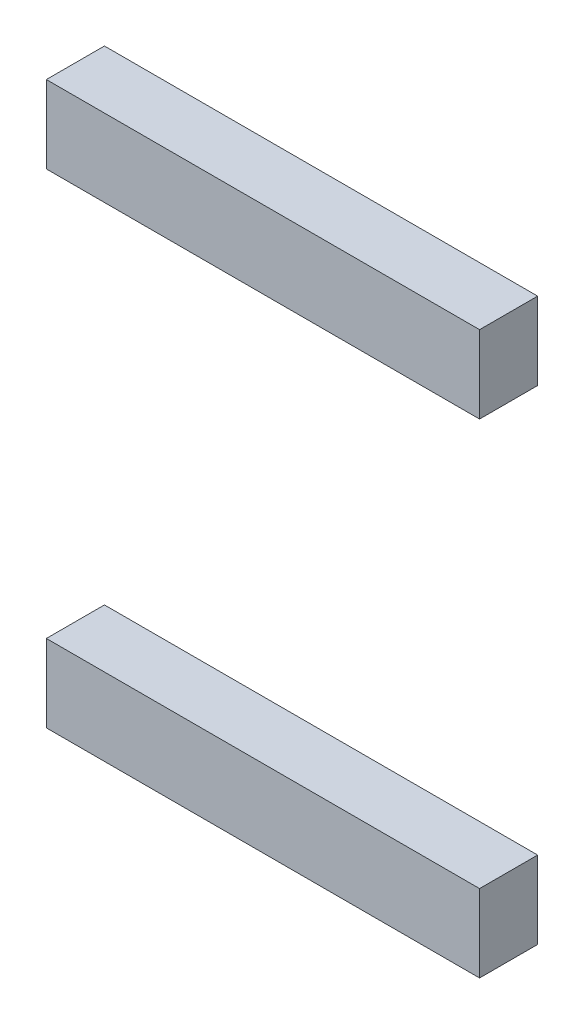
ISO-10303-21;
HEADER;
FILE_DESCRIPTION(('STEP AP214'),'2;1');
FILE_NAME('part.step','',(''),(''),'','','');
FILE_SCHEMA(('AUTOMOTIVE_DESIGN { 1 0 10303 214 1 1 1 1 }'));
ENDSEC;
DATA;
#1=APPLICATION_CONTEXT('core data for automotive mechanical design processes');
#2=APPLICATION_PROTOCOL_DEFINITION('international standard','automotive_design',2000,#1);
#3=PRODUCT_CONTEXT('',#1,'mechanical');
#4=PRODUCT('Part','Part','',(#3));
#5=PRODUCT_RELATED_PRODUCT_CATEGORY('part','',(#4));
#6=PRODUCT_DEFINITION_FORMATION('','',#4);
#7=PRODUCT_DEFINITION_CONTEXT('part definition',#1,'design');
#8=PRODUCT_DEFINITION('design','',#6,#7);
#9=PRODUCT_DEFINITION_SHAPE('','',#8);
#10=(LENGTH_UNIT() NAMED_UNIT(*) SI_UNIT(.MILLI.,.METRE.));
#11=(NAMED_UNIT(*) PLANE_ANGLE_UNIT() SI_UNIT($,.RADIAN.));
#12=(NAMED_UNIT(*) SI_UNIT($,.STERADIAN.) SOLID_ANGLE_UNIT());
#13=UNCERTAINTY_MEASURE_WITH_UNIT(LENGTH_MEASURE(1.E-05),#10,'distance_accuracy_value','');
#14=(GEOMETRIC_REPRESENTATION_CONTEXT(3) GLOBAL_UNCERTAINTY_ASSIGNED_CONTEXT((#13)) GLOBAL_UNIT_ASSIGNED_CONTEXT((#10,
#11,#12)) REPRESENTATION_CONTEXT('',''));
#15=CARTESIAN_POINT('',(0.,0.,0.));
#16=DIRECTION('',(0.,0.,1.));
#17=DIRECTION('',(1.,0.,0.));
#18=AXIS2_PLACEMENT_3D('',#15,#16,#17);
#19=CARTESIAN_POINT('',(-0.374999999999997,31.5,3.));
#20=DIRECTION('',(-1.,0.,0.));
#21=DIRECTION('',(0.,0.,1.));
#22=AXIS2_PLACEMENT_3D('',#19,#20,#21);
#23=PLANE('',#22);
#24=DIRECTION('',(0.,1.,0.));
#25=VECTOR('',#24,1.);
#26=CARTESIAN_POINT('',(-0.374999999999997,31.5,0.));
#27=LINE('',#26,#25);
#28=CARTESIAN_POINT('',(-0.374999999999997,31.5,0.));
#29=VERTEX_POINT('',#28);
#30=CARTESIAN_POINT('',(-0.374999999999997,35.5,0.));
#31=VERTEX_POINT('',#30);
#32=EDGE_CURVE('E106',#29,#31,#27,.T.);
#33=ORIENTED_EDGE('',*,*,#32,.T.);
#34=DIRECTION('',(0.,0.,-1.));
#35=VECTOR('',#34,1.);
#36=CARTESIAN_POINT('',(-0.374999999999997,35.5,3.));
#37=LINE('',#36,#35);
#38=CARTESIAN_POINT('',(-0.374999999999997,35.5,3.));
#39=VERTEX_POINT('',#38);
#40=EDGE_CURVE('E12',#39,#31,#37,.T.);
#41=ORIENTED_EDGE('',*,*,#40,.F.);
#42=DIRECTION('',(0.,1.,0.));
#43=VECTOR('',#42,1.);
#44=CARTESIAN_POINT('',(-0.374999999999997,31.5,3.));
#45=LINE('',#44,#43);
#46=CARTESIAN_POINT('',(-0.374999999999997,31.5,3.));
#47=VERTEX_POINT('',#46);
#48=EDGE_CURVE('E94',#47,#39,#45,.T.);
#49=ORIENTED_EDGE('',*,*,#48,.F.);
#50=DIRECTION('',(0.,0.,-1.));
#51=VECTOR('',#50,1.);
#52=CARTESIAN_POINT('',(-0.374999999999997,31.5,3.));
#53=LINE('',#52,#51);
#54=EDGE_CURVE('E102',#47,#29,#53,.T.);
#55=ORIENTED_EDGE('',*,*,#54,.T.);
#56=EDGE_LOOP('',(#33,#41,#49,#55));
#57=FACE_BOUND('',#56,.T.);
#58=ADVANCED_FACE('F43',(#57),#23,.F.);
#59=CARTESIAN_POINT('',(-0.374999999999997,35.5,3.));
#60=DIRECTION('',(0.,-1.,0.));
#61=DIRECTION('',(0.,0.,-1.));
#62=AXIS2_PLACEMENT_3D('',#59,#60,#61);
#63=PLANE('',#62);
#64=DIRECTION('',(-1.,0.,0.));
#65=VECTOR('',#64,1.);
#66=CARTESIAN_POINT('',(-0.374999999999997,35.5,0.));
#67=LINE('',#66,#65);
#68=CARTESIAN_POINT('',(-22.75,35.5,0.));
#69=VERTEX_POINT('',#68);
#70=EDGE_CURVE('E98',#31,#69,#67,.T.);
#71=ORIENTED_EDGE('',*,*,#70,.T.);
#72=DIRECTION('',(0.,0.,-1.));
#73=VECTOR('',#72,1.);
#74=CARTESIAN_POINT('',(-22.75,35.5,3.));
#75=LINE('',#74,#73);
#76=CARTESIAN_POINT('',(-22.75,35.5,3.));
#77=VERTEX_POINT('',#76);
#78=EDGE_CURVE('E51',#77,#69,#75,.T.);
#79=ORIENTED_EDGE('',*,*,#78,.F.);
#80=DIRECTION('',(-1.,0.,0.));
#81=VECTOR('',#80,1.);
#82=CARTESIAN_POINT('',(-0.374999999999997,35.5,3.));
#83=LINE('',#82,#81);
#84=EDGE_CURVE('E89',#39,#77,#83,.T.);
#85=ORIENTED_EDGE('',*,*,#84,.F.);
#86=ORIENTED_EDGE('',*,*,#40,.T.);
#87=EDGE_LOOP('',(#71,#79,#85,#86));
#88=FACE_BOUND('',#87,.T.);
#89=ADVANCED_FACE('F97',(#88),#63,.F.);
#90=CARTESIAN_POINT('',(-22.75,31.5,3.));
#91=DIRECTION('',(1.,0.,0.));
#92=DIRECTION('',(0.,0.,-1.));
#93=AXIS2_PLACEMENT_3D('',#90,#91,#92);
#94=PLANE('',#93);
#95=DIRECTION('',(0.,-1.,0.));
#96=VECTOR('',#95,1.);
#97=CARTESIAN_POINT('',(-22.75,31.5,0.));
#98=LINE('',#97,#96);
#99=CARTESIAN_POINT('',(-22.75,31.5,0.));
#100=VERTEX_POINT('',#99);
#101=EDGE_CURVE('E76',#69,#100,#98,.T.);
#102=ORIENTED_EDGE('',*,*,#101,.T.);
#103=DIRECTION('',(0.,0.,-1.));
#104=VECTOR('',#103,1.);
#105=CARTESIAN_POINT('',(-22.75,31.5,3.));
#106=LINE('',#105,#104);
#107=CARTESIAN_POINT('',(-22.75,31.5,3.));
#108=VERTEX_POINT('',#107);
#109=EDGE_CURVE('E99',#108,#100,#106,.T.);
#110=ORIENTED_EDGE('',*,*,#109,.F.);
#111=DIRECTION('',(0.,-1.,0.));
#112=VECTOR('',#111,1.);
#113=CARTESIAN_POINT('',(-22.75,31.5,3.));
#114=LINE('',#113,#112);
#115=EDGE_CURVE('E92',#77,#108,#114,.T.);
#116=ORIENTED_EDGE('',*,*,#115,.F.);
#117=ORIENTED_EDGE('',*,*,#78,.T.);
#118=EDGE_LOOP('',(#102,#110,#116,#117));
#119=FACE_BOUND('',#118,.T.);
#120=ADVANCED_FACE('F100',(#119),#94,.F.);
#121=CARTESIAN_POINT('',(-0.374999999999997,31.5,3.));
#122=DIRECTION('',(0.,1.,0.));
#123=DIRECTION('',(0.,0.,1.));
#124=AXIS2_PLACEMENT_3D('',#121,#122,#123);
#125=PLANE('',#124);
#126=DIRECTION('',(1.,0.,0.));
#127=VECTOR('',#126,1.);
#128=CARTESIAN_POINT('',(-0.374999999999997,31.5,0.));
#129=LINE('',#128,#127);
#130=EDGE_CURVE('E82',#100,#29,#129,.T.);
#131=ORIENTED_EDGE('',*,*,#130,.T.);
#132=ORIENTED_EDGE('',*,*,#54,.F.);
#133=DIRECTION('',(1.,0.,0.));
#134=VECTOR('',#133,1.);
#135=CARTESIAN_POINT('',(-0.374999999999997,31.5,3.));
#136=LINE('',#135,#134);
#137=EDGE_CURVE('E59',#108,#47,#136,.T.);
#138=ORIENTED_EDGE('',*,*,#137,.F.);
#139=ORIENTED_EDGE('',*,*,#109,.T.);
#140=EDGE_LOOP('',(#131,#132,#138,#139));
#141=FACE_BOUND('',#140,.T.);
#142=ADVANCED_FACE('F113',(#141),#125,.F.);
#143=CARTESIAN_POINT('',(0.,0.,3.));
#144=DIRECTION('',(0.,0.,1.));
#145=DIRECTION('',(1.,0.,0.));
#146=AXIS2_PLACEMENT_3D('',#143,#144,#145);
#147=PLANE('',#146);
#148=ORIENTED_EDGE('',*,*,#48,.T.);
#149=ORIENTED_EDGE('',*,*,#84,.T.);
#150=ORIENTED_EDGE('',*,*,#115,.T.);
#151=ORIENTED_EDGE('',*,*,#137,.T.);
#152=EDGE_LOOP('',(#148,#149,#150,#151));
#153=FACE_BOUND('',#152,.T.);
#154=ADVANCED_FACE('F90',(#153),#147,.T.);
#155=CARTESIAN_POINT('',(0.,0.,0.));
#156=DIRECTION('',(0.,0.,1.));
#157=DIRECTION('',(1.,0.,0.));
#158=AXIS2_PLACEMENT_3D('',#155,#156,#157);
#159=PLANE('',#158);
#160=ORIENTED_EDGE('',*,*,#32,.F.);
#161=ORIENTED_EDGE('',*,*,#130,.F.);
#162=ORIENTED_EDGE('',*,*,#101,.F.);
#163=ORIENTED_EDGE('',*,*,#70,.F.);
#164=EDGE_LOOP('',(#160,#161,#162,#163));
#165=FACE_BOUND('',#164,.T.);
#166=ADVANCED_FACE('F116',(#165),#159,.F.);
#167=CLOSED_SHELL('',(#58,#89,#120,#142,#154,#166));
#168=MANIFOLD_SOLID_BREP('B2',#167);
#169=CARTESIAN_POINT('',(-0.375,6.5,3.));
#170=DIRECTION('',(-1.,0.,0.));
#171=DIRECTION('',(0.,0.,1.));
#172=AXIS2_PLACEMENT_3D('',#169,#170,#171);
#173=PLANE('',#172);
#174=DIRECTION('',(0.,1.,0.));
#175=VECTOR('',#174,1.);
#176=CARTESIAN_POINT('',(-0.375,6.5,0.));
#177=LINE('',#176,#175);
#178=CARTESIAN_POINT('',(-0.375,6.5,0.));
#179=VERTEX_POINT('',#178);
#180=CARTESIAN_POINT('',(-0.375,10.5,0.));
#181=VERTEX_POINT('',#180);
#182=EDGE_CURVE('E230',#179,#181,#177,.T.);
#183=ORIENTED_EDGE('',*,*,#182,.T.);
#184=DIRECTION('',(0.,0.,-1.));
#185=VECTOR('',#184,1.);
#186=CARTESIAN_POINT('',(-0.375,10.5,3.));
#187=LINE('',#186,#185);
#188=CARTESIAN_POINT('',(-0.375,10.5,3.));
#189=VERTEX_POINT('',#188);
#190=EDGE_CURVE('E41',#189,#181,#187,.T.);
#191=ORIENTED_EDGE('',*,*,#190,.F.);
#192=DIRECTION('',(0.,1.,0.));
#193=VECTOR('',#192,1.);
#194=CARTESIAN_POINT('',(-0.375,6.5,3.));
#195=LINE('',#194,#193);
#196=CARTESIAN_POINT('',(-0.375,6.5,3.));
#197=VERTEX_POINT('',#196);
#198=EDGE_CURVE('E218',#197,#189,#195,.T.);
#199=ORIENTED_EDGE('',*,*,#198,.F.);
#200=DIRECTION('',(0.,0.,-1.));
#201=VECTOR('',#200,1.);
#202=CARTESIAN_POINT('',(-0.375,6.5,3.));
#203=LINE('',#202,#201);
#204=EDGE_CURVE('E226',#197,#179,#203,.T.);
#205=ORIENTED_EDGE('',*,*,#204,.T.);
#206=EDGE_LOOP('',(#183,#191,#199,#205));
#207=FACE_BOUND('',#206,.T.);
#208=ADVANCED_FACE('F167',(#207),#173,.F.);
#209=CARTESIAN_POINT('',(-0.375,10.5,3.));
#210=DIRECTION('',(0.,-1.,0.));
#211=DIRECTION('',(0.,0.,-1.));
#212=AXIS2_PLACEMENT_3D('',#209,#210,#211);
#213=PLANE('',#212);
#214=DIRECTION('',(-1.,0.,0.));
#215=VECTOR('',#214,1.);
#216=CARTESIAN_POINT('',(-0.375,10.5,0.));
#217=LINE('',#216,#215);
#218=CARTESIAN_POINT('',(-22.75,10.5,0.));
#219=VERTEX_POINT('',#218);
#220=EDGE_CURVE('E222',#181,#219,#217,.T.);
#221=ORIENTED_EDGE('',*,*,#220,.T.);
#222=DIRECTION('',(0.,0.,-1.));
#223=VECTOR('',#222,1.);
#224=CARTESIAN_POINT('',(-22.75,10.5,3.));
#225=LINE('',#224,#223);
#226=CARTESIAN_POINT('',(-22.75,10.5,3.));
#227=VERTEX_POINT('',#226);
#228=EDGE_CURVE('E175',#227,#219,#225,.T.);
#229=ORIENTED_EDGE('',*,*,#228,.F.);
#230=DIRECTION('',(-1.,0.,0.));
#231=VECTOR('',#230,1.);
#232=CARTESIAN_POINT('',(-0.375,10.5,3.));
#233=LINE('',#232,#231);
#234=EDGE_CURVE('E213',#189,#227,#233,.T.);
#235=ORIENTED_EDGE('',*,*,#234,.F.);
#236=ORIENTED_EDGE('',*,*,#190,.T.);
#237=EDGE_LOOP('',(#221,#229,#235,#236));
#238=FACE_BOUND('',#237,.T.);
#239=ADVANCED_FACE('F221',(#238),#213,.F.);
#240=CARTESIAN_POINT('',(-22.75,6.5,3.));
#241=DIRECTION('',(1.,0.,0.));
#242=DIRECTION('',(0.,0.,-1.));
#243=AXIS2_PLACEMENT_3D('',#240,#241,#242);
#244=PLANE('',#243);
#245=DIRECTION('',(0.,-1.,0.));
#246=VECTOR('',#245,1.);
#247=CARTESIAN_POINT('',(-22.75,6.5,0.));
#248=LINE('',#247,#246);
#249=CARTESIAN_POINT('',(-22.75,6.5,0.));
#250=VERTEX_POINT('',#249);
#251=EDGE_CURVE('E200',#219,#250,#248,.T.);
#252=ORIENTED_EDGE('',*,*,#251,.T.);
#253=DIRECTION('',(0.,0.,-1.));
#254=VECTOR('',#253,1.);
#255=CARTESIAN_POINT('',(-22.75,6.5,3.));
#256=LINE('',#255,#254);
#257=CARTESIAN_POINT('',(-22.75,6.5,3.));
#258=VERTEX_POINT('',#257);
#259=EDGE_CURVE('E223',#258,#250,#256,.T.);
#260=ORIENTED_EDGE('',*,*,#259,.F.);
#261=DIRECTION('',(0.,-1.,0.));
#262=VECTOR('',#261,1.);
#263=CARTESIAN_POINT('',(-22.75,6.5,3.));
#264=LINE('',#263,#262);
#265=EDGE_CURVE('E216',#227,#258,#264,.T.);
#266=ORIENTED_EDGE('',*,*,#265,.F.);
#267=ORIENTED_EDGE('',*,*,#228,.T.);
#268=EDGE_LOOP('',(#252,#260,#266,#267));
#269=FACE_BOUND('',#268,.T.);
#270=ADVANCED_FACE('F224',(#269),#244,.F.);
#271=CARTESIAN_POINT('',(-0.375,6.5,3.));
#272=DIRECTION('',(0.,1.,0.));
#273=DIRECTION('',(0.,0.,1.));
#274=AXIS2_PLACEMENT_3D('',#271,#272,#273);
#275=PLANE('',#274);
#276=DIRECTION('',(1.,0.,0.));
#277=VECTOR('',#276,1.);
#278=CARTESIAN_POINT('',(-0.375,6.5,0.));
#279=LINE('',#278,#277);
#280=EDGE_CURVE('E206',#250,#179,#279,.T.);
#281=ORIENTED_EDGE('',*,*,#280,.T.);
#282=ORIENTED_EDGE('',*,*,#204,.F.);
#283=DIRECTION('',(1.,0.,0.));
#284=VECTOR('',#283,1.);
#285=CARTESIAN_POINT('',(-0.375,6.5,3.));
#286=LINE('',#285,#284);
#287=EDGE_CURVE('E183',#258,#197,#286,.T.);
#288=ORIENTED_EDGE('',*,*,#287,.F.);
#289=ORIENTED_EDGE('',*,*,#259,.T.);
#290=EDGE_LOOP('',(#281,#282,#288,#289));
#291=FACE_BOUND('',#290,.T.);
#292=ADVANCED_FACE('F237',(#291),#275,.F.);
#293=CARTESIAN_POINT('',(0.,0.,3.));
#294=DIRECTION('',(0.,0.,1.));
#295=DIRECTION('',(1.,0.,0.));
#296=AXIS2_PLACEMENT_3D('',#293,#294,#295);
#297=PLANE('',#296);
#298=ORIENTED_EDGE('',*,*,#198,.T.);
#299=ORIENTED_EDGE('',*,*,#234,.T.);
#300=ORIENTED_EDGE('',*,*,#265,.T.);
#301=ORIENTED_EDGE('',*,*,#287,.T.);
#302=EDGE_LOOP('',(#298,#299,#300,#301));
#303=FACE_BOUND('',#302,.T.);
#304=ADVANCED_FACE('F214',(#303),#297,.T.);
#305=CARTESIAN_POINT('',(0.,0.,0.));
#306=DIRECTION('',(0.,0.,1.));
#307=DIRECTION('',(1.,0.,0.));
#308=AXIS2_PLACEMENT_3D('',#305,#306,#307);
#309=PLANE('',#308);
#310=ORIENTED_EDGE('',*,*,#182,.F.);
#311=ORIENTED_EDGE('',*,*,#280,.F.);
#312=ORIENTED_EDGE('',*,*,#251,.F.);
#313=ORIENTED_EDGE('',*,*,#220,.F.);
#314=EDGE_LOOP('',(#310,#311,#312,#313));
#315=FACE_BOUND('',#314,.T.);
#316=ADVANCED_FACE('F240',(#315),#309,.F.);
#317=CLOSED_SHELL('',(#208,#239,#270,#292,#304,#316));
#318=MANIFOLD_SOLID_BREP('B6',#317);
#319=ADVANCED_BREP_SHAPE_REPRESENTATION('',(#18,#168,#318),#14);
#320=SHAPE_DEFINITION_REPRESENTATION(#9,#319);
ENDSEC;
END-ISO-10303-21;
